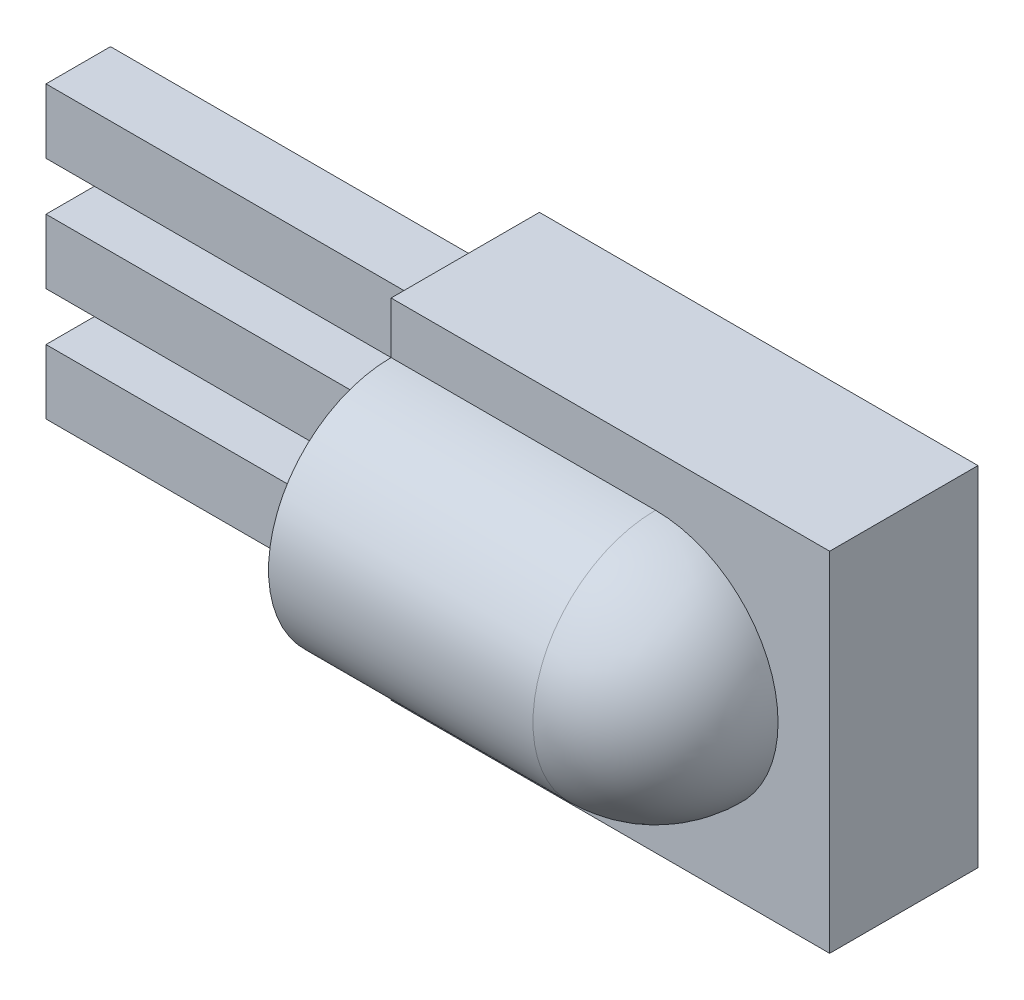
ISO-10303-21;
HEADER;
FILE_DESCRIPTION(('STEP AP214'),'2;1');
FILE_NAME('part.step','',(''),(''),'','','');
FILE_SCHEMA(('AUTOMOTIVE_DESIGN { 1 0 10303 214 1 1 1 1 }'));
ENDSEC;
DATA;
#1=APPLICATION_CONTEXT('core data for automotive mechanical design processes');
#2=APPLICATION_PROTOCOL_DEFINITION('international standard','automotive_design',2000,#1);
#3=PRODUCT_CONTEXT('',#1,'mechanical');
#4=PRODUCT('Part','Part','',(#3));
#5=PRODUCT_RELATED_PRODUCT_CATEGORY('part','',(#4));
#6=PRODUCT_DEFINITION_FORMATION('','',#4);
#7=PRODUCT_DEFINITION_CONTEXT('part definition',#1,'design');
#8=PRODUCT_DEFINITION('design','',#6,#7);
#9=PRODUCT_DEFINITION_SHAPE('','',#8);
#10=(LENGTH_UNIT() NAMED_UNIT(*) SI_UNIT(.MILLI.,.METRE.));
#11=(NAMED_UNIT(*) PLANE_ANGLE_UNIT() SI_UNIT($,.RADIAN.));
#12=(NAMED_UNIT(*) SI_UNIT($,.STERADIAN.) SOLID_ANGLE_UNIT());
#13=UNCERTAINTY_MEASURE_WITH_UNIT(LENGTH_MEASURE(1.E-05),#10,'distance_accuracy_value','');
#14=(GEOMETRIC_REPRESENTATION_CONTEXT(3) GLOBAL_UNCERTAINTY_ASSIGNED_CONTEXT((#13)) GLOBAL_UNIT_ASSIGNED_CONTEXT((#10,
#11,#12)) REPRESENTATION_CONTEXT('',''));
#15=CARTESIAN_POINT('',(0.,0.,0.));
#16=DIRECTION('',(0.,0.,1.));
#17=DIRECTION('',(1.,0.,0.));
#18=AXIS2_PLACEMENT_3D('',#15,#16,#17);
#19=CARTESIAN_POINT('',(0.,0.,2.3));
#20=DIRECTION('',(1.,0.,0.));
#21=DIRECTION('',(0.,0.,-1.));
#22=AXIS2_PLACEMENT_3D('',#19,#20,#21);
#23=PLANE('',#22);
#24=DIRECTION('',(0.,0.,-1.));
#25=VECTOR('',#24,1.);
#26=CARTESIAN_POINT('',(0.,4.95,1.64999999999999));
#27=LINE('',#26,#25);
#28=CARTESIAN_POINT('',(0.,4.95,1.64999999999999));
#29=VERTEX_POINT('',#28);
#30=CARTESIAN_POINT('',(0.,4.95,0.649999999999994));
#31=VERTEX_POINT('',#30);
#32=EDGE_CURVE('E181',#29,#31,#27,.T.);
#33=ORIENTED_EDGE('',*,*,#32,.F.);
#34=DIRECTION('',(0.,1.,0.));
#35=VECTOR('',#34,1.);
#36=CARTESIAN_POINT('',(0.,3.95,1.64999999999999));
#37=LINE('',#36,#35);
#38=CARTESIAN_POINT('',(0.,3.95,1.64999999999999));
#39=VERTEX_POINT('',#38);
#40=EDGE_CURVE('E194',#39,#29,#37,.T.);
#41=ORIENTED_EDGE('',*,*,#40,.F.);
#42=DIRECTION('',(0.,0.,1.));
#43=VECTOR('',#42,1.);
#44=CARTESIAN_POINT('',(0.,3.95,1.64999999999999));
#45=LINE('',#44,#43);
#46=CARTESIAN_POINT('',(0.,3.95,0.649999999999994));
#47=VERTEX_POINT('',#46);
#48=EDGE_CURVE('E203',#47,#39,#45,.T.);
#49=ORIENTED_EDGE('',*,*,#48,.F.);
#50=DIRECTION('',(0.,-1.,0.));
#51=VECTOR('',#50,1.);
#52=CARTESIAN_POINT('',(0.,3.95,0.649999999999994));
#53=LINE('',#52,#51);
#54=EDGE_CURVE('E184',#31,#47,#53,.T.);
#55=ORIENTED_EDGE('',*,*,#54,.F.);
#56=EDGE_LOOP('',(#33,#41,#49,#55));
#57=FACE_BOUND('',#56,.T.);
#58=DIRECTION('',(0.,-1.,0.));
#59=VECTOR('',#58,1.);
#60=CARTESIAN_POINT('',(0.,0.,2.3));
#61=LINE('',#60,#59);
#62=CARTESIAN_POINT('',(0.,0.800000000000001,2.3));
#63=VERTEX_POINT('',#62);
#64=CARTESIAN_POINT('',(0.,0.,2.3));
#65=VERTEX_POINT('',#64);
#66=EDGE_CURVE('E259',#63,#65,#61,.T.);
#67=ORIENTED_EDGE('',*,*,#66,.F.);
#68=CARTESIAN_POINT('',(0.,2.7,2.3));
#69=DIRECTION('',(-1.,0.,0.));
#70=DIRECTION('',(0.,0.,1.));
#71=AXIS2_PLACEMENT_3D('',#68,#69,#70);
#72=CIRCLE('',#71,1.9);
#73=CARTESIAN_POINT('',(0.,4.6,2.3));
#74=VERTEX_POINT('',#73);
#75=EDGE_CURVE('E252',#63,#74,#72,.T.);
#76=ORIENTED_EDGE('',*,*,#75,.T.);
#77=CARTESIAN_POINT('',(0.,5.4,2.3));
#78=VERTEX_POINT('',#77);
#79=EDGE_CURVE('E256',#78,#74,#61,.T.);
#80=ORIENTED_EDGE('',*,*,#79,.F.);
#81=DIRECTION('',(0.,0.,-1.));
#82=VECTOR('',#81,1.);
#83=CARTESIAN_POINT('',(0.,5.4,2.3));
#84=LINE('',#83,#82);
#85=CARTESIAN_POINT('',(0.,5.4,0.));
#86=VERTEX_POINT('',#85);
#87=EDGE_CURVE('E265',#78,#86,#84,.T.);
#88=ORIENTED_EDGE('',*,*,#87,.T.);
#89=DIRECTION('',(0.,-1.,0.));
#90=VECTOR('',#89,1.);
#91=CARTESIAN_POINT('',(0.,0.,0.));
#92=LINE('',#91,#90);
#93=CARTESIAN_POINT('',(0.,0.,0.));
#94=VERTEX_POINT('',#93);
#95=EDGE_CURVE('E255',#86,#94,#92,.T.);
#96=ORIENTED_EDGE('',*,*,#95,.T.);
#97=DIRECTION('',(0.,0.,-1.));
#98=VECTOR('',#97,1.);
#99=CARTESIAN_POINT('',(0.,0.,2.3));
#100=LINE('',#99,#98);
#101=EDGE_CURVE('E282',#65,#94,#100,.T.);
#102=ORIENTED_EDGE('',*,*,#101,.F.);
#103=EDGE_LOOP('',(#67,#76,#80,#88,#96,#102));
#104=FACE_BOUND('',#103,.T.);
#105=DIRECTION('',(0.,-1.,0.));
#106=VECTOR('',#105,1.);
#107=CARTESIAN_POINT('',(0.,2.2,0.65));
#108=LINE('',#107,#106);
#109=CARTESIAN_POINT('',(0.,3.2,0.65));
#110=VERTEX_POINT('',#109);
#111=CARTESIAN_POINT('',(0.,2.2,0.65));
#112=VERTEX_POINT('',#111);
#113=EDGE_CURVE('E219',#110,#112,#108,.T.);
#114=ORIENTED_EDGE('',*,*,#113,.F.);
#115=DIRECTION('',(0.,0.,-1.));
#116=VECTOR('',#115,1.);
#117=CARTESIAN_POINT('',(0.,3.2,1.65));
#118=LINE('',#117,#116);
#119=CARTESIAN_POINT('',(0.,3.2,1.65));
#120=VERTEX_POINT('',#119);
#121=EDGE_CURVE('E224',#120,#110,#118,.T.);
#122=ORIENTED_EDGE('',*,*,#121,.F.);
#123=DIRECTION('',(0.,1.,0.));
#124=VECTOR('',#123,1.);
#125=CARTESIAN_POINT('',(0.,2.2,1.65));
#126=LINE('',#125,#124);
#127=CARTESIAN_POINT('',(0.,2.2,1.65));
#128=VERTEX_POINT('',#127);
#129=EDGE_CURVE('E236',#128,#120,#126,.T.);
#130=ORIENTED_EDGE('',*,*,#129,.F.);
#131=DIRECTION('',(0.,0.,1.));
#132=VECTOR('',#131,1.);
#133=CARTESIAN_POINT('',(0.,2.2,1.65));
#134=LINE('',#133,#132);
#135=EDGE_CURVE('E233',#112,#128,#134,.T.);
#136=ORIENTED_EDGE('',*,*,#135,.F.);
#137=EDGE_LOOP('',(#114,#122,#130,#136));
#138=FACE_BOUND('',#137,.T.);
#139=DIRECTION('',(0.,0.,-1.));
#140=VECTOR('',#139,1.);
#141=CARTESIAN_POINT('',(0.,1.45,1.65000000000002));
#142=LINE('',#141,#140);
#143=CARTESIAN_POINT('',(0.,1.45,1.65000000000002));
#144=VERTEX_POINT('',#143);
#145=CARTESIAN_POINT('',(0.,1.45,0.650000000000018));
#146=VERTEX_POINT('',#145);
#147=EDGE_CURVE('E180',#144,#146,#142,.T.);
#148=ORIENTED_EDGE('',*,*,#147,.F.);
#149=DIRECTION('',(0.,1.,0.));
#150=VECTOR('',#149,1.);
#151=CARTESIAN_POINT('',(0.,0.450000000000001,1.65000000000002));
#152=LINE('',#151,#150);
#153=CARTESIAN_POINT('',(0.,0.450000000000001,1.65000000000002));
#154=VERTEX_POINT('',#153);
#155=EDGE_CURVE('E177',#154,#144,#152,.T.);
#156=ORIENTED_EDGE('',*,*,#155,.F.);
#157=DIRECTION('',(0.,0.,1.));
#158=VECTOR('',#157,1.);
#159=CARTESIAN_POINT('',(0.,0.450000000000001,1.65000000000002));
#160=LINE('',#159,#158);
#161=CARTESIAN_POINT('',(0.,0.450000000000001,0.650000000000018));
#162=VERTEX_POINT('',#161);
#163=EDGE_CURVE('E53',#162,#154,#160,.T.);
#164=ORIENTED_EDGE('',*,*,#163,.F.);
#165=DIRECTION('',(0.,-1.,0.));
#166=VECTOR('',#165,1.);
#167=CARTESIAN_POINT('',(0.,0.450000000000001,0.650000000000018));
#168=LINE('',#167,#166);
#169=EDGE_CURVE('E48',#146,#162,#168,.T.);
#170=ORIENTED_EDGE('',*,*,#169,.F.);
#171=EDGE_LOOP('',(#148,#156,#164,#170));
#172=FACE_BOUND('',#171,.T.);
#173=ADVANCED_FACE('F33',(#57,#104,#138,#172),#23,.F.);
#174=CARTESIAN_POINT('',(0.,0.,2.3));
#175=DIRECTION('',(0.,1.,0.));
#176=DIRECTION('',(0.,0.,1.));
#177=AXIS2_PLACEMENT_3D('',#174,#175,#176);
#178=PLANE('',#177);
#179=DIRECTION('',(1.,0.,0.));
#180=VECTOR('',#179,1.);
#181=CARTESIAN_POINT('',(0.,0.,0.));
#182=LINE('',#181,#180);
#183=CARTESIAN_POINT('',(6.8,0.,0.));
#184=VERTEX_POINT('',#183);
#185=EDGE_CURVE('E268',#94,#184,#182,.T.);
#186=ORIENTED_EDGE('',*,*,#185,.T.);
#187=DIRECTION('',(0.,0.,-1.));
#188=VECTOR('',#187,1.);
#189=CARTESIAN_POINT('',(6.8,0.,2.3));
#190=LINE('',#189,#188);
#191=CARTESIAN_POINT('',(6.8,0.,2.3));
#192=VERTEX_POINT('',#191);
#193=EDGE_CURVE('E279',#192,#184,#190,.T.);
#194=ORIENTED_EDGE('',*,*,#193,.F.);
#195=DIRECTION('',(1.,0.,0.));
#196=VECTOR('',#195,1.);
#197=CARTESIAN_POINT('',(0.,0.,2.3));
#198=LINE('',#197,#196);
#199=EDGE_CURVE('E258',#65,#192,#198,.T.);
#200=ORIENTED_EDGE('',*,*,#199,.F.);
#201=ORIENTED_EDGE('',*,*,#101,.T.);
#202=EDGE_LOOP('',(#186,#194,#200,#201));
#203=FACE_BOUND('',#202,.T.);
#204=ADVANCED_FACE('F310',(#203),#178,.F.);
#205=CARTESIAN_POINT('',(6.8,0.,2.3));
#206=DIRECTION('',(-1.,0.,0.));
#207=DIRECTION('',(0.,-1.,0.));
#208=AXIS2_PLACEMENT_3D('',#205,#206,#207);
#209=PLANE('',#208);
#210=DIRECTION('',(0.,1.,0.));
#211=VECTOR('',#210,1.);
#212=CARTESIAN_POINT('',(6.8,0.,0.));
#213=LINE('',#212,#211);
#214=CARTESIAN_POINT('',(6.8,5.4,0.));
#215=VERTEX_POINT('',#214);
#216=EDGE_CURVE('E270',#184,#215,#213,.T.);
#217=ORIENTED_EDGE('',*,*,#216,.T.);
#218=DIRECTION('',(0.,0.,-1.));
#219=VECTOR('',#218,1.);
#220=CARTESIAN_POINT('',(6.8,5.4,2.3));
#221=LINE('',#220,#219);
#222=CARTESIAN_POINT('',(6.8,5.4,2.3));
#223=VERTEX_POINT('',#222);
#224=EDGE_CURVE('E276',#223,#215,#221,.T.);
#225=ORIENTED_EDGE('',*,*,#224,.F.);
#226=DIRECTION('',(0.,1.,0.));
#227=VECTOR('',#226,1.);
#228=CARTESIAN_POINT('',(6.8,0.,2.3));
#229=LINE('',#228,#227);
#230=EDGE_CURVE('E261',#192,#223,#229,.T.);
#231=ORIENTED_EDGE('',*,*,#230,.F.);
#232=ORIENTED_EDGE('',*,*,#193,.T.);
#233=EDGE_LOOP('',(#217,#225,#231,#232));
#234=FACE_BOUND('',#233,.T.);
#235=ADVANCED_FACE('F317',(#234),#209,.F.);
#236=CARTESIAN_POINT('',(0.,5.4,2.3));
#237=DIRECTION('',(0.,-1.,0.));
#238=DIRECTION('',(0.,0.,-1.));
#239=AXIS2_PLACEMENT_3D('',#236,#237,#238);
#240=PLANE('',#239);
#241=DIRECTION('',(-1.,0.,0.));
#242=VECTOR('',#241,1.);
#243=CARTESIAN_POINT('',(0.,5.4,0.));
#244=LINE('',#243,#242);
#245=EDGE_CURVE('E272',#215,#86,#244,.T.);
#246=ORIENTED_EDGE('',*,*,#245,.T.);
#247=ORIENTED_EDGE('',*,*,#87,.F.);
#248=DIRECTION('',(-1.,0.,0.));
#249=VECTOR('',#248,1.);
#250=CARTESIAN_POINT('',(0.,5.4,2.3));
#251=LINE('',#250,#249);
#252=EDGE_CURVE('E263',#223,#78,#251,.T.);
#253=ORIENTED_EDGE('',*,*,#252,.F.);
#254=ORIENTED_EDGE('',*,*,#224,.T.);
#255=EDGE_LOOP('',(#246,#247,#253,#254));
#256=FACE_BOUND('',#255,.T.);
#257=ADVANCED_FACE('F321',(#256),#240,.F.);
#258=CARTESIAN_POINT('',(0.,0.,2.3));
#259=DIRECTION('',(0.,0.,-1.));
#260=DIRECTION('',(-1.,0.,0.));
#261=AXIS2_PLACEMENT_3D('',#258,#259,#260);
#262=PLANE('',#261);
#263=CARTESIAN_POINT('',(4.1,2.7,2.3));
#264=DIRECTION('',(0.,0.,-1.));
#265=DIRECTION('',(-1.,0.,0.));
#266=AXIS2_PLACEMENT_3D('',#263,#264,#265);
#267=CIRCLE('',#266,1.9);
#268=CARTESIAN_POINT('',(4.1,4.6,2.3));
#269=VERTEX_POINT('',#268);
#270=CARTESIAN_POINT('',(6.,2.7,2.3));
#271=VERTEX_POINT('',#270);
#272=EDGE_CURVE('E41',#269,#271,#267,.T.);
#273=ORIENTED_EDGE('',*,*,#272,.T.);
#274=CARTESIAN_POINT('',(4.1,2.7,2.3));
#275=DIRECTION('',(0.,0.,-1.));
#276=DIRECTION('',(-1.,0.,0.));
#277=AXIS2_PLACEMENT_3D('',#274,#275,#276);
#278=CIRCLE('',#277,1.9);
#279=CARTESIAN_POINT('',(4.1,0.800000000000001,2.3));
#280=VERTEX_POINT('',#279);
#281=EDGE_CURVE('E11',#271,#280,#278,.T.);
#282=ORIENTED_EDGE('',*,*,#281,.T.);
#283=DIRECTION('',(-1.,0.,0.));
#284=VECTOR('',#283,1.);
#285=CARTESIAN_POINT('',(6.,0.800000000000001,2.3));
#286=LINE('',#285,#284);
#287=EDGE_CURVE('E288',#280,#63,#286,.T.);
#288=ORIENTED_EDGE('',*,*,#287,.T.);
#289=ORIENTED_EDGE('',*,*,#66,.T.);
#290=ORIENTED_EDGE('',*,*,#199,.T.);
#291=ORIENTED_EDGE('',*,*,#230,.T.);
#292=ORIENTED_EDGE('',*,*,#252,.T.);
#293=ORIENTED_EDGE('',*,*,#79,.T.);
#294=DIRECTION('',(-1.,0.,0.));
#295=VECTOR('',#294,1.);
#296=CARTESIAN_POINT('',(6.,4.6,2.3));
#297=LINE('',#296,#295);
#298=EDGE_CURVE('E285',#74,#269,#297,.F.);
#299=ORIENTED_EDGE('',*,*,#298,.T.);
#300=EDGE_LOOP('',(#273,#282,#288,#289,#290,#291,#292,#293,#299));
#301=FACE_BOUND('',#300,.T.);
#302=ADVANCED_FACE('F294',(#301),#262,.F.);
#303=CARTESIAN_POINT('',(0.,0.,0.));
#304=DIRECTION('',(0.,0.,-1.));
#305=DIRECTION('',(-1.,0.,0.));
#306=AXIS2_PLACEMENT_3D('',#303,#304,#305);
#307=PLANE('',#306);
#308=ORIENTED_EDGE('',*,*,#95,.F.);
#309=ORIENTED_EDGE('',*,*,#245,.F.);
#310=ORIENTED_EDGE('',*,*,#216,.F.);
#311=ORIENTED_EDGE('',*,*,#185,.F.);
#312=EDGE_LOOP('',(#308,#309,#310,#311));
#313=FACE_BOUND('',#312,.T.);
#314=ADVANCED_FACE('F323',(#313),#307,.T.);
#315=CARTESIAN_POINT('',(6.,2.7,2.3));
#316=DIRECTION('',(-1.,0.,0.));
#317=DIRECTION('',(0.,0.,1.));
#318=AXIS2_PLACEMENT_3D('',#315,#316,#317);
#319=CYLINDRICAL_SURFACE('',#318,1.9);
#320=ORIENTED_EDGE('',*,*,#287,.F.);
#321=CARTESIAN_POINT('',(4.1,2.7,2.3));
#322=DIRECTION('',(-1.,0.,0.));
#323=DIRECTION('',(0.,0.,1.));
#324=AXIS2_PLACEMENT_3D('',#321,#322,#323);
#325=CIRCLE('',#324,1.9);
#326=EDGE_CURVE('E290',#280,#269,#325,.T.);
#327=ORIENTED_EDGE('',*,*,#326,.T.);
#328=ORIENTED_EDGE('',*,*,#298,.F.);
#329=ORIENTED_EDGE('',*,*,#75,.F.);
#330=EDGE_LOOP('',(#320,#327,#328,#329));
#331=FACE_BOUND('',#330,.T.);
#332=ADVANCED_FACE('F300',(#331),#319,.T.);
#333=CARTESIAN_POINT('',(4.1,2.7,2.3));
#334=DIRECTION('',(-1.,0.,0.));
#335=DIRECTION('',(0.,0.,1.));
#336=AXIS2_PLACEMENT_3D('',#333,#334,#335);
#337=SPHERICAL_SURFACE('',#336,1.9);
#338=ORIENTED_EDGE('',*,*,#326,.F.);
#339=ORIENTED_EDGE('',*,*,#281,.F.);
#340=ORIENTED_EDGE('',*,*,#272,.F.);
#341=EDGE_LOOP('',(#338,#339,#340));
#342=FACE_BOUND('',#341,.T.);
#343=ADVANCED_FACE('F35',(#342),#337,.T.);
#344=CARTESIAN_POINT('',(-6.,2.2,0.65));
#345=DIRECTION('',(0.,0.,1.));
#346=DIRECTION('',(1.,0.,0.));
#347=AXIS2_PLACEMENT_3D('',#344,#345,#346);
#348=PLANE('',#347);
#349=ORIENTED_EDGE('',*,*,#113,.T.);
#350=DIRECTION('',(1.,0.,0.));
#351=VECTOR('',#350,1.);
#352=CARTESIAN_POINT('',(-6.,2.2,0.65));
#353=LINE('',#352,#351);
#354=CARTESIAN_POINT('',(-6.,2.2,0.65));
#355=VERTEX_POINT('',#354);
#356=EDGE_CURVE('E249',#355,#112,#353,.T.);
#357=ORIENTED_EDGE('',*,*,#356,.F.);
#358=DIRECTION('',(0.,-1.,0.));
#359=VECTOR('',#358,1.);
#360=CARTESIAN_POINT('',(-6.,2.2,0.65));
#361=LINE('',#360,#359);
#362=CARTESIAN_POINT('',(-6.,3.2,0.65));
#363=VERTEX_POINT('',#362);
#364=EDGE_CURVE('E220',#363,#355,#361,.T.);
#365=ORIENTED_EDGE('',*,*,#364,.F.);
#366=DIRECTION('',(1.,0.,0.));
#367=VECTOR('',#366,1.);
#368=CARTESIAN_POINT('',(-6.,3.2,0.65));
#369=LINE('',#368,#367);
#370=EDGE_CURVE('E230',#363,#110,#369,.T.);
#371=ORIENTED_EDGE('',*,*,#370,.T.);
#372=EDGE_LOOP('',(#349,#357,#365,#371));
#373=FACE_BOUND('',#372,.T.);
#374=ADVANCED_FACE('F366',(#373),#348,.F.);
#375=CARTESIAN_POINT('',(-6.,2.2,1.65));
#376=DIRECTION('',(0.,1.,0.));
#377=DIRECTION('',(0.,0.,1.));
#378=AXIS2_PLACEMENT_3D('',#375,#376,#377);
#379=PLANE('',#378);
#380=ORIENTED_EDGE('',*,*,#135,.T.);
#381=DIRECTION('',(1.,0.,0.));
#382=VECTOR('',#381,1.);
#383=CARTESIAN_POINT('',(-6.,2.2,1.65));
#384=LINE('',#383,#382);
#385=CARTESIAN_POINT('',(-6.,2.2,1.65));
#386=VERTEX_POINT('',#385);
#387=EDGE_CURVE('E246',#386,#128,#384,.T.);
#388=ORIENTED_EDGE('',*,*,#387,.F.);
#389=DIRECTION('',(0.,0.,1.));
#390=VECTOR('',#389,1.);
#391=CARTESIAN_POINT('',(-6.,2.2,1.65));
#392=LINE('',#391,#390);
#393=EDGE_CURVE('E223',#355,#386,#392,.T.);
#394=ORIENTED_EDGE('',*,*,#393,.F.);
#395=ORIENTED_EDGE('',*,*,#356,.T.);
#396=EDGE_LOOP('',(#380,#388,#394,#395));
#397=FACE_BOUND('',#396,.T.);
#398=ADVANCED_FACE('F380',(#397),#379,.F.);
#399=CARTESIAN_POINT('',(-6.,2.2,1.65));
#400=DIRECTION('',(0.,0.,-1.));
#401=DIRECTION('',(-1.,0.,0.));
#402=AXIS2_PLACEMENT_3D('',#399,#400,#401);
#403=PLANE('',#402);
#404=ORIENTED_EDGE('',*,*,#129,.T.);
#405=DIRECTION('',(1.,0.,0.));
#406=VECTOR('',#405,1.);
#407=CARTESIAN_POINT('',(-6.,3.2,1.65));
#408=LINE('',#407,#406);
#409=CARTESIAN_POINT('',(-6.,3.2,1.65));
#410=VERTEX_POINT('',#409);
#411=EDGE_CURVE('E243',#410,#120,#408,.T.);
#412=ORIENTED_EDGE('',*,*,#411,.F.);
#413=DIRECTION('',(0.,1.,0.));
#414=VECTOR('',#413,1.);
#415=CARTESIAN_POINT('',(-6.,2.2,1.65));
#416=LINE('',#415,#414);
#417=EDGE_CURVE('E226',#386,#410,#416,.T.);
#418=ORIENTED_EDGE('',*,*,#417,.F.);
#419=ORIENTED_EDGE('',*,*,#387,.T.);
#420=EDGE_LOOP('',(#404,#412,#418,#419));
#421=FACE_BOUND('',#420,.T.);
#422=ADVANCED_FACE('F390',(#421),#403,.F.);
#423=CARTESIAN_POINT('',(-6.,3.2,1.65));
#424=DIRECTION('',(0.,-1.,0.));
#425=DIRECTION('',(0.,0.,-1.));
#426=AXIS2_PLACEMENT_3D('',#423,#424,#425);
#427=PLANE('',#426);
#428=ORIENTED_EDGE('',*,*,#121,.T.);
#429=ORIENTED_EDGE('',*,*,#370,.F.);
#430=DIRECTION('',(0.,0.,-1.));
#431=VECTOR('',#430,1.);
#432=CARTESIAN_POINT('',(-6.,3.2,1.65));
#433=LINE('',#432,#431);
#434=EDGE_CURVE('E228',#410,#363,#433,.T.);
#435=ORIENTED_EDGE('',*,*,#434,.F.);
#436=ORIENTED_EDGE('',*,*,#411,.T.);
#437=EDGE_LOOP('',(#428,#429,#435,#436));
#438=FACE_BOUND('',#437,.T.);
#439=ADVANCED_FACE('F400',(#438),#427,.F.);
#440=CARTESIAN_POINT('',(-6.,0.,0.));
#441=DIRECTION('',(-1.,0.,0.));
#442=DIRECTION('',(0.,0.,1.));
#443=AXIS2_PLACEMENT_3D('',#440,#441,#442);
#444=PLANE('',#443);
#445=ORIENTED_EDGE('',*,*,#364,.T.);
#446=ORIENTED_EDGE('',*,*,#393,.T.);
#447=ORIENTED_EDGE('',*,*,#417,.T.);
#448=ORIENTED_EDGE('',*,*,#434,.T.);
#449=EDGE_LOOP('',(#445,#446,#447,#448));
#450=FACE_BOUND('',#449,.T.);
#451=ADVANCED_FACE('F410',(#450),#444,.T.);
#452=CARTESIAN_POINT('',(-6.,4.95,1.64999999999999));
#453=DIRECTION('',(0.,-1.,0.));
#454=DIRECTION('',(0.,0.,-1.));
#455=AXIS2_PLACEMENT_3D('',#452,#453,#454);
#456=PLANE('',#455);
#457=ORIENTED_EDGE('',*,*,#32,.T.);
#458=DIRECTION('',(1.,0.,0.));
#459=VECTOR('',#458,1.);
#460=CARTESIAN_POINT('',(-6.,4.95,0.649999999999994));
#461=LINE('',#460,#459);
#462=CARTESIAN_POINT('',(-6.,4.95,0.649999999999994));
#463=VERTEX_POINT('',#462);
#464=EDGE_CURVE('E216',#463,#31,#461,.T.);
#465=ORIENTED_EDGE('',*,*,#464,.F.);
#466=DIRECTION('',(0.,0.,-1.));
#467=VECTOR('',#466,1.);
#468=CARTESIAN_POINT('',(-6.,4.95,1.64999999999999));
#469=LINE('',#468,#467);
#470=CARTESIAN_POINT('',(-6.,4.95,1.64999999999999));
#471=VERTEX_POINT('',#470);
#472=EDGE_CURVE('E190',#471,#463,#469,.T.);
#473=ORIENTED_EDGE('',*,*,#472,.F.);
#474=DIRECTION('',(1.,0.,0.));
#475=VECTOR('',#474,1.);
#476=CARTESIAN_POINT('',(-6.,4.95,1.64999999999999));
#477=LINE('',#476,#475);
#478=EDGE_CURVE('E199',#471,#29,#477,.T.);
#479=ORIENTED_EDGE('',*,*,#478,.T.);
#480=EDGE_LOOP('',(#457,#465,#473,#479));
#481=FACE_BOUND('',#480,.T.);
#482=ADVANCED_FACE('F420',(#481),#456,.F.);
#483=CARTESIAN_POINT('',(-6.,3.95,0.649999999999994));
#484=DIRECTION('',(0.,0.,1.));
#485=DIRECTION('',(1.,0.,0.));
#486=AXIS2_PLACEMENT_3D('',#483,#484,#485);
#487=PLANE('',#486);
#488=ORIENTED_EDGE('',*,*,#54,.T.);
#489=DIRECTION('',(1.,0.,0.));
#490=VECTOR('',#489,1.);
#491=CARTESIAN_POINT('',(-6.,3.95,0.649999999999994));
#492=LINE('',#491,#490);
#493=CARTESIAN_POINT('',(-6.,3.95,0.649999999999994));
#494=VERTEX_POINT('',#493);
#495=EDGE_CURVE('E213',#494,#47,#492,.T.);
#496=ORIENTED_EDGE('',*,*,#495,.F.);
#497=DIRECTION('',(0.,-1.,0.));
#498=VECTOR('',#497,1.);
#499=CARTESIAN_POINT('',(-6.,3.95,0.649999999999994));
#500=LINE('',#499,#498);
#501=EDGE_CURVE('E193',#463,#494,#500,.T.);
#502=ORIENTED_EDGE('',*,*,#501,.F.);
#503=ORIENTED_EDGE('',*,*,#464,.T.);
#504=EDGE_LOOP('',(#488,#496,#502,#503));
#505=FACE_BOUND('',#504,.T.);
#506=ADVANCED_FACE('F430',(#505),#487,.F.);
#507=CARTESIAN_POINT('',(-6.,3.95,1.64999999999999));
#508=DIRECTION('',(0.,1.,0.));
#509=DIRECTION('',(0.,0.,1.));
#510=AXIS2_PLACEMENT_3D('',#507,#508,#509);
#511=PLANE('',#510);
#512=ORIENTED_EDGE('',*,*,#48,.T.);
#513=DIRECTION('',(1.,0.,0.));
#514=VECTOR('',#513,1.);
#515=CARTESIAN_POINT('',(-6.,3.95,1.64999999999999));
#516=LINE('',#515,#514);
#517=CARTESIAN_POINT('',(-6.,3.95,1.64999999999999));
#518=VERTEX_POINT('',#517);
#519=EDGE_CURVE('E210',#518,#39,#516,.T.);
#520=ORIENTED_EDGE('',*,*,#519,.F.);
#521=DIRECTION('',(0.,0.,1.));
#522=VECTOR('',#521,1.);
#523=CARTESIAN_POINT('',(-6.,3.95,1.64999999999999));
#524=LINE('',#523,#522);
#525=EDGE_CURVE('E196',#494,#518,#524,.T.);
#526=ORIENTED_EDGE('',*,*,#525,.F.);
#527=ORIENTED_EDGE('',*,*,#495,.T.);
#528=EDGE_LOOP('',(#512,#520,#526,#527));
#529=FACE_BOUND('',#528,.T.);
#530=ADVANCED_FACE('F440',(#529),#511,.F.);
#531=CARTESIAN_POINT('',(-6.,3.95,1.64999999999999));
#532=DIRECTION('',(0.,0.,-1.));
#533=DIRECTION('',(-1.,0.,0.));
#534=AXIS2_PLACEMENT_3D('',#531,#532,#533);
#535=PLANE('',#534);
#536=ORIENTED_EDGE('',*,*,#40,.T.);
#537=ORIENTED_EDGE('',*,*,#478,.F.);
#538=DIRECTION('',(0.,1.,0.));
#539=VECTOR('',#538,1.);
#540=CARTESIAN_POINT('',(-6.,3.95,1.64999999999999));
#541=LINE('',#540,#539);
#542=EDGE_CURVE('E198',#518,#471,#541,.T.);
#543=ORIENTED_EDGE('',*,*,#542,.F.);
#544=ORIENTED_EDGE('',*,*,#519,.T.);
#545=EDGE_LOOP('',(#536,#537,#543,#544));
#546=FACE_BOUND('',#545,.T.);
#547=ADVANCED_FACE('F450',(#546),#535,.F.);
#548=CARTESIAN_POINT('',(-6.,0.,0.));
#549=DIRECTION('',(1.,0.,0.));
#550=DIRECTION('',(0.,0.,-1.));
#551=AXIS2_PLACEMENT_3D('',#548,#549,#550);
#552=PLANE('',#551);
#553=ORIENTED_EDGE('',*,*,#472,.T.);
#554=ORIENTED_EDGE('',*,*,#501,.T.);
#555=ORIENTED_EDGE('',*,*,#525,.T.);
#556=ORIENTED_EDGE('',*,*,#542,.T.);
#557=EDGE_LOOP('',(#553,#554,#555,#556));
#558=FACE_BOUND('',#557,.T.);
#559=ADVANCED_FACE('F460',(#558),#552,.F.);
#560=CARTESIAN_POINT('',(-6.,1.45,1.65000000000002));
#561=DIRECTION('',(0.,-1.,0.));
#562=DIRECTION('',(0.,0.,-1.));
#563=AXIS2_PLACEMENT_3D('',#560,#561,#562);
#564=PLANE('',#563);
#565=ORIENTED_EDGE('',*,*,#147,.T.);
#566=DIRECTION('',(1.,0.,0.));
#567=VECTOR('',#566,1.);
#568=CARTESIAN_POINT('',(-6.,1.45,0.650000000000018));
#569=LINE('',#568,#567);
#570=CARTESIAN_POINT('',(-6.,1.45,0.650000000000018));
#571=VERTEX_POINT('',#570);
#572=EDGE_CURVE('E161',#571,#146,#569,.T.);
#573=ORIENTED_EDGE('',*,*,#572,.F.);
#574=DIRECTION('',(0.,0.,-1.));
#575=VECTOR('',#574,1.);
#576=CARTESIAN_POINT('',(-6.,1.45,1.65000000000002));
#577=LINE('',#576,#575);
#578=CARTESIAN_POINT('',(-6.,1.45,1.65000000000002));
#579=VERTEX_POINT('',#578);
#580=EDGE_CURVE('E168',#579,#571,#577,.T.);
#581=ORIENTED_EDGE('',*,*,#580,.F.);
#582=DIRECTION('',(1.,0.,0.));
#583=VECTOR('',#582,1.);
#584=CARTESIAN_POINT('',(-6.,1.45,1.65000000000002));
#585=LINE('',#584,#583);
#586=EDGE_CURVE('E520',#579,#144,#585,.T.);
#587=ORIENTED_EDGE('',*,*,#586,.T.);
#588=EDGE_LOOP('',(#565,#573,#581,#587));
#589=FACE_BOUND('',#588,.T.);
#590=ADVANCED_FACE('F179',(#589),#564,.F.);
#591=CARTESIAN_POINT('',(-6.,0.450000000000001,0.650000000000018));
#592=DIRECTION('',(0.,0.,1.));
#593=DIRECTION('',(1.,0.,0.));
#594=AXIS2_PLACEMENT_3D('',#591,#592,#593);
#595=PLANE('',#594);
#596=ORIENTED_EDGE('',*,*,#169,.T.);
#597=DIRECTION('',(1.,0.,0.));
#598=VECTOR('',#597,1.);
#599=CARTESIAN_POINT('',(-6.,0.450000000000001,0.650000000000018));
#600=LINE('',#599,#598);
#601=CARTESIAN_POINT('',(-6.,0.450000000000001,0.650000000000018));
#602=VERTEX_POINT('',#601);
#603=EDGE_CURVE('E164',#602,#162,#600,.T.);
#604=ORIENTED_EDGE('',*,*,#603,.F.);
#605=DIRECTION('',(0.,-1.,0.));
#606=VECTOR('',#605,1.);
#607=CARTESIAN_POINT('',(-6.,0.450000000000001,0.650000000000018));
#608=LINE('',#607,#606);
#609=EDGE_CURVE('E157',#571,#602,#608,.T.);
#610=ORIENTED_EDGE('',*,*,#609,.F.);
#611=ORIENTED_EDGE('',*,*,#572,.T.);
#612=EDGE_LOOP('',(#596,#604,#610,#611));
#613=FACE_BOUND('',#612,.T.);
#614=ADVANCED_FACE('F159',(#613),#595,.F.);
#615=CARTESIAN_POINT('',(-6.,0.450000000000001,1.65000000000002));
#616=DIRECTION('',(0.,1.,0.));
#617=DIRECTION('',(0.,0.,1.));
#618=AXIS2_PLACEMENT_3D('',#615,#616,#617);
#619=PLANE('',#618);
#620=ORIENTED_EDGE('',*,*,#163,.T.);
#621=DIRECTION('',(1.,0.,0.));
#622=VECTOR('',#621,1.);
#623=CARTESIAN_POINT('',(-6.,0.450000000000001,1.65000000000002));
#624=LINE('',#623,#622);
#625=CARTESIAN_POINT('',(-6.,0.450000000000001,1.65000000000002));
#626=VERTEX_POINT('',#625);
#627=EDGE_CURVE('E186',#626,#154,#624,.T.);
#628=ORIENTED_EDGE('',*,*,#627,.F.);
#629=DIRECTION('',(0.,0.,1.));
#630=VECTOR('',#629,1.);
#631=CARTESIAN_POINT('',(-6.,0.450000000000001,1.65000000000002));
#632=LINE('',#631,#630);
#633=EDGE_CURVE('E167',#602,#626,#632,.T.);
#634=ORIENTED_EDGE('',*,*,#633,.F.);
#635=ORIENTED_EDGE('',*,*,#603,.T.);
#636=EDGE_LOOP('',(#620,#628,#634,#635));
#637=FACE_BOUND('',#636,.T.);
#638=ADVANCED_FACE('F487',(#637),#619,.F.);
#639=CARTESIAN_POINT('',(-6.,0.450000000000001,1.65000000000002));
#640=DIRECTION('',(0.,0.,-1.));
#641=DIRECTION('',(-1.,0.,0.));
#642=AXIS2_PLACEMENT_3D('',#639,#640,#641);
#643=PLANE('',#642);
#644=ORIENTED_EDGE('',*,*,#155,.T.);
#645=ORIENTED_EDGE('',*,*,#586,.F.);
#646=DIRECTION('',(0.,1.,0.));
#647=VECTOR('',#646,1.);
#648=CARTESIAN_POINT('',(-6.,0.450000000000001,1.65000000000002));
#649=LINE('',#648,#647);
#650=EDGE_CURVE('E173',#626,#579,#649,.T.);
#651=ORIENTED_EDGE('',*,*,#650,.F.);
#652=ORIENTED_EDGE('',*,*,#627,.T.);
#653=EDGE_LOOP('',(#644,#645,#651,#652));
#654=FACE_BOUND('',#653,.T.);
#655=ADVANCED_FACE('F496',(#654),#643,.F.);
#656=CARTESIAN_POINT('',(-6.,0.,0.));
#657=DIRECTION('',(1.,0.,0.));
#658=DIRECTION('',(0.,0.,-1.));
#659=AXIS2_PLACEMENT_3D('',#656,#657,#658);
#660=PLANE('',#659);
#661=ORIENTED_EDGE('',*,*,#580,.T.);
#662=ORIENTED_EDGE('',*,*,#609,.T.);
#663=ORIENTED_EDGE('',*,*,#633,.T.);
#664=ORIENTED_EDGE('',*,*,#650,.T.);
#665=EDGE_LOOP('',(#661,#662,#663,#664));
#666=FACE_BOUND('',#665,.T.);
#667=ADVANCED_FACE('F171',(#666),#660,.F.);
#668=CLOSED_SHELL('',(#173,#204,#235,#257,#302,#314,#332,#343,#374,#398,#422,#439,#451,#482,
#506,#530,#547,#559,#590,#614,#638,#655,#667));
#669=MANIFOLD_SOLID_BREP('B2',#668);
#670=ADVANCED_BREP_SHAPE_REPRESENTATION('',(#18,#669),#14);
#671=SHAPE_DEFINITION_REPRESENTATION(#9,#670);
ENDSEC;
END-ISO-10303-21;
